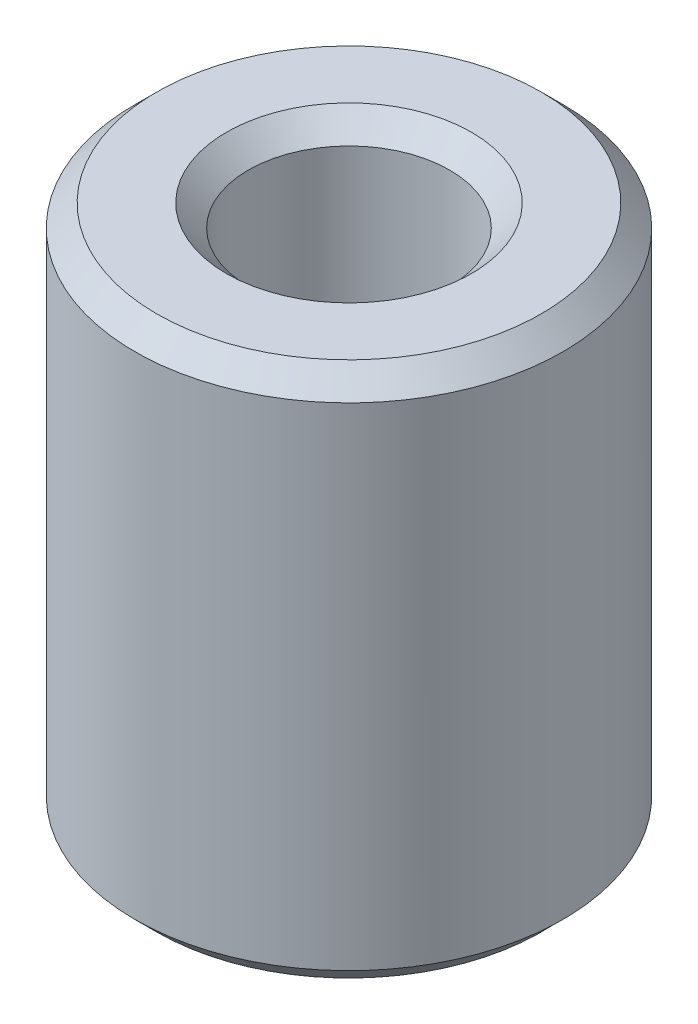
ISO-10303-21;
HEADER;
FILE_DESCRIPTION(('STEP AP214'),'2;1');
FILE_NAME('part.step','',(''),(''),'','','');
FILE_SCHEMA(('AUTOMOTIVE_DESIGN { 1 0 10303 214 1 1 1 1 }'));
ENDSEC;
DATA;
#1=APPLICATION_CONTEXT('core data for automotive mechanical design processes');
#2=APPLICATION_PROTOCOL_DEFINITION('international standard','automotive_design',2000,#1);
#3=PRODUCT_CONTEXT('',#1,'mechanical');
#4=PRODUCT('Part','Part','',(#3));
#5=PRODUCT_RELATED_PRODUCT_CATEGORY('part','',(#4));
#6=PRODUCT_DEFINITION_FORMATION('','',#4);
#7=PRODUCT_DEFINITION_CONTEXT('part definition',#1,'design');
#8=PRODUCT_DEFINITION('design','',#6,#7);
#9=PRODUCT_DEFINITION_SHAPE('','',#8);
#10=(LENGTH_UNIT() NAMED_UNIT(*) SI_UNIT(.MILLI.,.METRE.));
#11=(NAMED_UNIT(*) PLANE_ANGLE_UNIT() SI_UNIT($,.RADIAN.));
#12=(NAMED_UNIT(*) SI_UNIT($,.STERADIAN.) SOLID_ANGLE_UNIT());
#13=UNCERTAINTY_MEASURE_WITH_UNIT(LENGTH_MEASURE(1.E-05),#10,'distance_accuracy_value','');
#14=(GEOMETRIC_REPRESENTATION_CONTEXT(3) GLOBAL_UNCERTAINTY_ASSIGNED_CONTEXT((#13)) GLOBAL_UNIT_ASSIGNED_CONTEXT((#10,
#11,#12)) REPRESENTATION_CONTEXT('',''));
#15=CARTESIAN_POINT('',(0.,0.,0.));
#16=DIRECTION('',(0.,0.,1.));
#17=DIRECTION('',(1.,0.,0.));
#18=AXIS2_PLACEMENT_3D('',#15,#16,#17);
#19=CARTESIAN_POINT('',(0.,12.5053869454506,0.));
#20=DIRECTION('',(0.,-1.,0.));
#21=DIRECTION('',(0.,0.,-1.));
#22=AXIS2_PLACEMENT_3D('',#19,#20,#21);
#23=CYLINDRICAL_SURFACE('',#22,5.);
#24=CARTESIAN_POINT('',(0.,0.510197850316269,0.));
#25=DIRECTION('',(0.,1.,0.));
#26=DIRECTION('',(0.,0.,1.));
#27=AXIS2_PLACEMENT_3D('',#24,#25,#26);
#28=CIRCLE('',#27,5.);
#29=CARTESIAN_POINT('',(0.,0.510197850316269,-5.));
#30=VERTEX_POINT('',#29);
#31=EDGE_CURVE('E10',#30,#30,#28,.T.);
#32=CARTESIAN_POINT('',(0.,11.9951890951343,0.));
#33=DIRECTION('',(0.,1.,0.));
#34=DIRECTION('',(0.,0.,1.));
#35=AXIS2_PLACEMENT_3D('',#32,#33,#34);
#36=CIRCLE('',#35,5.);
#37=CARTESIAN_POINT('',(0.,11.9951890951343,-5.));
#38=VERTEX_POINT('',#37);
#39=EDGE_CURVE('E50',#38,#38,#36,.F.);
#40=CARTESIAN_POINT('',(0.,0.510197850316269,-5.));
#41=CARTESIAN_POINT('',(0.,0.629833175783124,-5.));
#42=CARTESIAN_POINT('',(0.,0.749468501249979,-5.));
#43=CARTESIAN_POINT('',(0.,0.988739152183689,-5.));
#44=CARTESIAN_POINT('',(0.,1.10837447765054,-5.));
#45=CARTESIAN_POINT('',(0.,1.34764512858425,-5.));
#46=CARTESIAN_POINT('',(0.,1.46728045405111,-5.));
#47=CARTESIAN_POINT('',(0.,1.70655110498482,-5.));
#48=CARTESIAN_POINT('',(0.,1.82618643045167,-5.));
#49=CARTESIAN_POINT('',(0.,2.06545708138538,-5.));
#50=CARTESIAN_POINT('',(0.,2.18509240685224,-5.));
#51=CARTESIAN_POINT('',(0.,2.42436305778595,-5.));
#52=CARTESIAN_POINT('',(0.,2.5439983832528,-5.));
#53=CARTESIAN_POINT('',(0.,2.78326903418651,-5.));
#54=CARTESIAN_POINT('',(0.,2.90290435965337,-5.));
#55=CARTESIAN_POINT('',(0.,3.14217501058708,-5.));
#56=CARTESIAN_POINT('',(0.,3.26181033605393,-5.));
#57=CARTESIAN_POINT('',(0.,3.50108098698764,-5.));
#58=CARTESIAN_POINT('',(0.,3.6207163124545,-5.));
#59=CARTESIAN_POINT('',(0.,3.85998696338821,-5.));
#60=CARTESIAN_POINT('',(0.,3.97962228885506,-5.));
#61=CARTESIAN_POINT('',(0.,4.21889293978877,-5.));
#62=CARTESIAN_POINT('',(0.,4.33852826525563,-5.));
#63=CARTESIAN_POINT('',(0.,4.57779891618934,-5.));
#64=CARTESIAN_POINT('',(0.,4.69743424165619,-5.));
#65=CARTESIAN_POINT('',(0.,4.9367048925899,-5.));
#66=CARTESIAN_POINT('',(0.,5.05634021805676,-5.));
#67=CARTESIAN_POINT('',(0.,5.29561086899047,-5.));
#68=CARTESIAN_POINT('',(0.,5.41524619445732,-5.));
#69=CARTESIAN_POINT('',(0.,5.65451684539103,-5.));
#70=CARTESIAN_POINT('',(0.,5.77415217085789,-5.));
#71=CARTESIAN_POINT('',(0.,6.0134228217916,-5.));
#72=CARTESIAN_POINT('',(0.,6.13305814725845,-5.));
#73=CARTESIAN_POINT('',(0.,6.37232879819216,-5.));
#74=CARTESIAN_POINT('',(0.,6.49196412365902,-5.));
#75=CARTESIAN_POINT('',(0.,6.73123477459273,-5.));
#76=CARTESIAN_POINT('',(0.,6.85087010005958,-5.));
#77=CARTESIAN_POINT('',(0.,7.09014075099329,-5.));
#78=CARTESIAN_POINT('',(0.,7.20977607646015,-5.));
#79=CARTESIAN_POINT('',(0.,7.44904672739386,-5.));
#80=CARTESIAN_POINT('',(0.,7.56868205286071,-5.));
#81=CARTESIAN_POINT('',(0.,7.80795270379442,-5.));
#82=CARTESIAN_POINT('',(0.,7.92758802926128,-5.));
#83=CARTESIAN_POINT('',(0.,8.16685868019499,-5.));
#84=CARTESIAN_POINT('',(0.,8.28649400566184,-5.));
#85=CARTESIAN_POINT('',(0.,8.52576465659555,-5.));
#86=CARTESIAN_POINT('',(0.,8.64539998206241,-5.));
#87=CARTESIAN_POINT('',(0.,8.88467063299611,-5.));
#88=CARTESIAN_POINT('',(0.,9.00430595846297,-5.));
#89=CARTESIAN_POINT('',(0.,9.24357660939668,-5.));
#90=CARTESIAN_POINT('',(0.,9.36321193486353,-5.));
#91=CARTESIAN_POINT('',(0.,9.60248258579724,-5.));
#92=CARTESIAN_POINT('',(0.,9.7221179112641,-5.));
#93=CARTESIAN_POINT('',(0.,9.96138856219781,-5.));
#94=CARTESIAN_POINT('',(0.,10.0810238876647,-5.));
#95=CARTESIAN_POINT('',(0.,10.3202945385984,-5.));
#96=CARTESIAN_POINT('',(0.,10.4399298640652,-5.));
#97=CARTESIAN_POINT('',(0.,10.6792005149989,-5.));
#98=CARTESIAN_POINT('',(0.,10.7988358404658,-5.));
#99=CARTESIAN_POINT('',(0.,11.0381064913995,-5.));
#100=CARTESIAN_POINT('',(0.,11.1577418168664,-5.));
#101=CARTESIAN_POINT('',(0.,11.3970124678001,-5.));
#102=CARTESIAN_POINT('',(0.,11.5166477932669,-5.));
#103=CARTESIAN_POINT('',(0.,11.7559184442006,-5.));
#104=CARTESIAN_POINT('',(0.,11.8755537696675,-5.));
#105=CARTESIAN_POINT('',(0.,11.9951890951343,-5.));
#106=B_SPLINE_CURVE_WITH_KNOTS('',3,(#40,#41,#42,#43,#44,#45,#46,#47,#48,#49,#50,#51,#52,#53,
#54,#55,#56,#57,#58,#59,#60,#61,#62,#63,#64,#65,#66,#67,#68,#69,#70,#71,#72,#73,#74,#75,#76,#77,
#78,#79,#80,#81,#82,#83,#84,#85,#86,#87,#88,#89,#90,#91,#92,#93,#94,#95,#96,#97,#98,#99,#100,
#101,#102,#103,#104,#105),.UNSPECIFIED.,.F.,.F.,(4,2,2,2,2,2,2,2,2,2,2,2,2,2,2,2,2,2,2,2,2,2,2,
2,2,2,2,2,2,2,2,2,4),(0.,0.358905976400564,0.71781195280113,1.07671792920169,1.43562390560226,
1.79452988200282,2.15343585840339,2.51234183480395,2.87124781120452,3.23015378760508,
3.58905976400565,3.94796574040621,4.30687171680678,4.66577769320734,5.02468366960791,
5.38358964600847,5.74249562240904,6.1014015988096,6.46030757521017,6.81921355161073,
7.1781195280113,7.53702550441186,7.89593148081243,8.25483745721299,8.61374343361356,
8.97264941001412,9.33155538641468,9.69046136281525,10.0493673392158,10.4082733156164,
10.7671792920169,11.1260852684175,11.4849912448181),.UNSPECIFIED.);
#107=EDGE_CURVE('BSEAM39',#30,#38,#106,.T.);
#108=ORIENTED_EDGE('',*,*,#31,.T.);
#109=ORIENTED_EDGE('',*,*,#39,.T.);
#110=ORIENTED_EDGE('',*,*,#107,.T.);
#111=ORIENTED_EDGE('',*,*,#107,.F.);
#112=EDGE_LOOP('',(#108,#110,#109,#111));
#113=FACE_BOUND('',#112,.T.);
#114=ADVANCED_FACE('F39',(#113),#23,.T.);
#115=CARTESIAN_POINT('',(0.,12.5053869454506,0.));
#116=DIRECTION('',(0.,1.,0.));
#117=DIRECTION('',(0.,0.,1.));
#118=AXIS2_PLACEMENT_3D('',#115,#116,#117);
#119=PLANE('',#118);
#120=CARTESIAN_POINT('',(0.,12.5053869454506,0.));
#121=DIRECTION('',(0.,1.,0.));
#122=DIRECTION('',(0.,0.,1.));
#123=AXIS2_PLACEMENT_3D('',#120,#121,#122);
#124=CIRCLE('',#123,2.86159839954905);
#125=CARTESIAN_POINT('',(0.,12.5053869454506,2.86159839954905));
#126=VERTEX_POINT('',#125);
#127=EDGE_CURVE('E58',#126,#126,#124,.F.);
#128=ORIENTED_EDGE('',*,*,#127,.T.);
#129=EDGE_LOOP('',(#128));
#130=FACE_BOUND('',#129,.T.);
#131=CARTESIAN_POINT('',(0.,12.5053869454506,0.));
#132=DIRECTION('',(0.,1.,0.));
#133=DIRECTION('',(0.,0.,1.));
#134=AXIS2_PLACEMENT_3D('',#131,#132,#133);
#135=CIRCLE('',#134,4.48980214968375);
#136=CARTESIAN_POINT('',(0.,12.5053869454506,4.48980214968375));
#137=VERTEX_POINT('',#136);
#138=EDGE_CURVE('E61',#137,#137,#135,.T.);
#139=ORIENTED_EDGE('',*,*,#138,.T.);
#140=EDGE_LOOP('',(#139));
#141=FACE_BOUND('',#140,.T.);
#142=ADVANCED_FACE('F88',(#130,#141),#119,.T.);
#143=CARTESIAN_POINT('',(0.,0.,0.));
#144=DIRECTION('',(0.,1.,0.));
#145=DIRECTION('',(0.,0.,1.));
#146=AXIS2_PLACEMENT_3D('',#143,#144,#145);
#147=PLANE('',#146);
#148=CARTESIAN_POINT('',(0.,0.,0.));
#149=DIRECTION('',(0.,1.,0.));
#150=DIRECTION('',(0.,0.,1.));
#151=AXIS2_PLACEMENT_3D('',#148,#149,#150);
#152=CIRCLE('',#151,2.86159839954903);
#153=CARTESIAN_POINT('',(0.,0.,2.86159839954903));
#154=VERTEX_POINT('',#153);
#155=EDGE_CURVE('E51',#154,#154,#152,.T.);
#156=ORIENTED_EDGE('',*,*,#155,.T.);
#157=EDGE_LOOP('',(#156));
#158=FACE_BOUND('',#157,.T.);
#159=CARTESIAN_POINT('',(0.,0.,0.));
#160=DIRECTION('',(0.,1.,0.));
#161=DIRECTION('',(0.,0.,1.));
#162=AXIS2_PLACEMENT_3D('',#159,#160,#161);
#163=CIRCLE('',#162,4.48980214968373);
#164=CARTESIAN_POINT('',(0.,0.,4.48980214968373));
#165=VERTEX_POINT('',#164);
#166=EDGE_CURVE('E54',#165,#165,#163,.F.);
#167=ORIENTED_EDGE('',*,*,#166,.T.);
#168=EDGE_LOOP('',(#167));
#169=FACE_BOUND('',#168,.T.);
#170=ADVANCED_FACE('F83',(#158,#169),#147,.F.);
#171=CARTESIAN_POINT('',(0.,12.5053869454506,0.));
#172=DIRECTION('',(0.,-1.,0.));
#173=DIRECTION('',(0.,0.,-1.));
#174=AXIS2_PLACEMENT_3D('',#171,#172,#173);
#175=CYLINDRICAL_SURFACE('',#174,2.35140054923278);
#176=CARTESIAN_POINT('',(0.,11.9951890951343,0.));
#177=DIRECTION('',(0.,1.,0.));
#178=DIRECTION('',(0.,0.,1.));
#179=AXIS2_PLACEMENT_3D('',#176,#177,#178);
#180=CIRCLE('',#179,2.35140054923278);
#181=CARTESIAN_POINT('',(0.,11.9951890951343,-2.35140054923278));
#182=VERTEX_POINT('',#181);
#183=EDGE_CURVE('E67',#182,#182,#180,.T.);
#184=CARTESIAN_POINT('',(0.,0.510197850316261,0.));
#185=DIRECTION('',(0.,1.,0.));
#186=DIRECTION('',(0.,0.,1.));
#187=AXIS2_PLACEMENT_3D('',#184,#185,#186);
#188=CIRCLE('',#187,2.35140054923278);
#189=CARTESIAN_POINT('',(0.,0.510197850316259,-2.35140054923278));
#190=VERTEX_POINT('',#189);
#191=EDGE_CURVE('E69',#190,#190,#188,.F.);
#192=CARTESIAN_POINT('',(0.,11.9951890951343,-2.35140054923278));
#193=CARTESIAN_POINT('',(0.,11.8755537696675,-2.35140054923278));
#194=CARTESIAN_POINT('',(0.,11.7559184442006,-2.35140054923278));
#195=CARTESIAN_POINT('',(0.,11.5166477932669,-2.35140054923278));
#196=CARTESIAN_POINT('',(0.,11.3970124678001,-2.35140054923278));
#197=CARTESIAN_POINT('',(0.,11.1577418168664,-2.35140054923278));
#198=CARTESIAN_POINT('',(0.,11.0381064913995,-2.35140054923278));
#199=CARTESIAN_POINT('',(0.,10.7988358404658,-2.35140054923278));
#200=CARTESIAN_POINT('',(0.,10.6792005149989,-2.35140054923278));
#201=CARTESIAN_POINT('',(0.,10.4399298640652,-2.35140054923278));
#202=CARTESIAN_POINT('',(0.,10.3202945385984,-2.35140054923278));
#203=CARTESIAN_POINT('',(0.,10.0810238876647,-2.35140054923278));
#204=CARTESIAN_POINT('',(0.,9.9613885621978,-2.35140054923278));
#205=CARTESIAN_POINT('',(0.,9.72211791126409,-2.35140054923278));
#206=CARTESIAN_POINT('',(0.,9.60248258579723,-2.35140054923278));
#207=CARTESIAN_POINT('',(0.,9.36321193486352,-2.35140054923278));
#208=CARTESIAN_POINT('',(0.,9.24357660939667,-2.35140054923278));
#209=CARTESIAN_POINT('',(0.,9.00430595846296,-2.35140054923278));
#210=CARTESIAN_POINT('',(0.,8.8846706329961,-2.35140054923278));
#211=CARTESIAN_POINT('',(0.,8.6453999820624,-2.35140054923278));
#212=CARTESIAN_POINT('',(0.,8.52576465659554,-2.35140054923278));
#213=CARTESIAN_POINT('',(0.,8.28649400566183,-2.35140054923278));
#214=CARTESIAN_POINT('',(0.,8.16685868019498,-2.35140054923278));
#215=CARTESIAN_POINT('',(0.,7.92758802926127,-2.35140054923278));
#216=CARTESIAN_POINT('',(0.,7.80795270379441,-2.35140054923278));
#217=CARTESIAN_POINT('',(0.,7.5686820528607,-2.35140054923278));
#218=CARTESIAN_POINT('',(0.,7.44904672739385,-2.35140054923278));
#219=CARTESIAN_POINT('',(0.,7.20977607646014,-2.35140054923278));
#220=CARTESIAN_POINT('',(0.,7.09014075099328,-2.35140054923278));
#221=CARTESIAN_POINT('',(0.,6.85087010005957,-2.35140054923278));
#222=CARTESIAN_POINT('',(0.,6.73123477459272,-2.35140054923278));
#223=CARTESIAN_POINT('',(0.,6.49196412365901,-2.35140054923278));
#224=CARTESIAN_POINT('',(0.,6.37232879819215,-2.35140054923278));
#225=CARTESIAN_POINT('',(0.,6.13305814725844,-2.35140054923278));
#226=CARTESIAN_POINT('',(0.,6.01342282179159,-2.35140054923278));
#227=CARTESIAN_POINT('',(0.,5.77415217085788,-2.35140054923278));
#228=CARTESIAN_POINT('',(0.,5.65451684539102,-2.35140054923278));
#229=CARTESIAN_POINT('',(0.,5.41524619445731,-2.35140054923278));
#230=CARTESIAN_POINT('',(0.,5.29561086899046,-2.35140054923278));
#231=CARTESIAN_POINT('',(0.,5.05634021805675,-2.35140054923278));
#232=CARTESIAN_POINT('',(0.,4.93670489258989,-2.35140054923278));
#233=CARTESIAN_POINT('',(0.,4.69743424165618,-2.35140054923278));
#234=CARTESIAN_POINT('',(0.,4.57779891618933,-2.35140054923278));
#235=CARTESIAN_POINT('',(0.,4.33852826525562,-2.35140054923278));
#236=CARTESIAN_POINT('',(0.,4.21889293978876,-2.35140054923278));
#237=CARTESIAN_POINT('',(0.,3.97962228885505,-2.35140054923278));
#238=CARTESIAN_POINT('',(0.,3.8599869633882,-2.35140054923278));
#239=CARTESIAN_POINT('',(0.,3.62071631245449,-2.35140054923278));
#240=CARTESIAN_POINT('',(0.,3.50108098698763,-2.35140054923278));
#241=CARTESIAN_POINT('',(0.,3.26181033605392,-2.35140054923278));
#242=CARTESIAN_POINT('',(0.,3.14217501058707,-2.35140054923278));
#243=CARTESIAN_POINT('',(0.,2.90290435965336,-2.35140054923278));
#244=CARTESIAN_POINT('',(0.,2.7832690341865,-2.35140054923278));
#245=CARTESIAN_POINT('',(0.,2.54399838325279,-2.35140054923278));
#246=CARTESIAN_POINT('',(0.,2.42436305778594,-2.35140054923278));
#247=CARTESIAN_POINT('',(0.,2.18509240685223,-2.35140054923278));
#248=CARTESIAN_POINT('',(0.,2.06545708138537,-2.35140054923278));
#249=CARTESIAN_POINT('',(0.,1.82618643045166,-2.35140054923278));
#250=CARTESIAN_POINT('',(0.,1.70655110498481,-2.35140054923278));
#251=CARTESIAN_POINT('',(0.,1.4672804540511,-2.35140054923278));
#252=CARTESIAN_POINT('',(0.,1.34764512858424,-2.35140054923278));
#253=CARTESIAN_POINT('',(0.,1.10837447765053,-2.35140054923278));
#254=CARTESIAN_POINT('',(0.,0.988739152183678,-2.35140054923278));
#255=CARTESIAN_POINT('',(0.,0.749468501249968,-2.35140054923278));
#256=CARTESIAN_POINT('',(0.,0.629833175783113,-2.35140054923278));
#257=CARTESIAN_POINT('',(0.,0.510197850316259,-2.35140054923278));
#258=B_SPLINE_CURVE_WITH_KNOTS('',3,(#192,#193,#194,#195,#196,#197,#198,#199,#200,#201,#202,
#203,#204,#205,#206,#207,#208,#209,#210,#211,#212,#213,#214,#215,#216,#217,#218,#219,#220,#221,
#222,#223,#224,#225,#226,#227,#228,#229,#230,#231,#232,#233,#234,#235,#236,#237,#238,#239,#240,
#241,#242,#243,#244,#245,#246,#247,#248,#249,#250,#251,#252,#253,#254,#255,#256,#257),
.UNSPECIFIED.,.F.,.F.,(4,2,2,2,2,2,2,2,2,2,2,2,2,2,2,2,2,2,2,2,2,2,2,2,2,2,2,2,2,2,2,2,4),(0.,
0.358905976400564,0.717811952801128,1.07671792920169,1.43562390560226,1.79452988200282,
2.15343585840339,2.51234183480395,2.87124781120452,3.23015378760508,3.58905976400565,
3.94796574040621,4.30687171680678,4.66577769320734,5.02468366960791,5.38358964600847,
5.74249562240904,6.1014015988096,6.46030757521017,6.81921355161073,7.1781195280113,
7.53702550441186,7.89593148081242,8.25483745721299,8.61374343361356,8.97264941001412,
9.33155538641468,9.69046136281525,10.0493673392158,10.4082733156164,10.7671792920169,
11.1260852684175,11.4849912448181),.UNSPECIFIED.);
#259=EDGE_CURVE('BSEAM71',#182,#190,#258,.T.);
#260=ORIENTED_EDGE('',*,*,#183,.T.);
#261=ORIENTED_EDGE('',*,*,#191,.T.);
#262=ORIENTED_EDGE('',*,*,#259,.T.);
#263=ORIENTED_EDGE('',*,*,#259,.F.);
#264=EDGE_LOOP('',(#260,#262,#261,#263));
#265=FACE_BOUND('',#264,.T.);
#266=ADVANCED_FACE('F71',(#265),#175,.F.);
#267=CARTESIAN_POINT('',(0.,11.9951890951343,0.));
#268=DIRECTION('',(0.,1.,0.));
#269=DIRECTION('',(0.,0.,1.));
#270=AXIS2_PLACEMENT_3D('',#267,#268,#269);
#271=CONICAL_SURFACE('',#270,2.35140054923278,0.785398163397454);
#272=ORIENTED_EDGE('',*,*,#127,.F.);
#273=EDGE_LOOP('',(#272));
#274=FACE_BOUND('',#273,.T.);
#275=ORIENTED_EDGE('',*,*,#183,.F.);
#276=EDGE_LOOP('',(#275));
#277=FACE_BOUND('',#276,.T.);
#278=ADVANCED_FACE('F77',(#274,#277),#271,.F.);
#279=CARTESIAN_POINT('',(0.,0.,0.));
#280=DIRECTION('',(0.,-1.,0.));
#281=DIRECTION('',(0.,0.,-1.));
#282=AXIS2_PLACEMENT_3D('',#279,#280,#281);
#283=CONICAL_SURFACE('',#282,2.86159839954903,0.785398163397442);
#284=ORIENTED_EDGE('',*,*,#191,.F.);
#285=EDGE_LOOP('',(#284));
#286=FACE_BOUND('',#285,.T.);
#287=ORIENTED_EDGE('',*,*,#155,.F.);
#288=EDGE_LOOP('',(#287));
#289=FACE_BOUND('',#288,.T.);
#290=ADVANCED_FACE('F73',(#286,#289),#283,.F.);
#291=CARTESIAN_POINT('',(0.,0.510197850316269,0.));
#292=DIRECTION('',(0.,1.,0.));
#293=DIRECTION('',(0.,0.,1.));
#294=AXIS2_PLACEMENT_3D('',#291,#292,#293);
#295=CONICAL_SURFACE('',#294,5.,0.785398163397452);
#296=ORIENTED_EDGE('',*,*,#166,.F.);
#297=EDGE_LOOP('',(#296));
#298=FACE_BOUND('',#297,.T.);
#299=ORIENTED_EDGE('',*,*,#31,.F.);
#300=EDGE_LOOP('',(#299));
#301=FACE_BOUND('',#300,.T.);
#302=ADVANCED_FACE('F76',(#298,#301),#295,.T.);
#303=CARTESIAN_POINT('',(0.,12.5053869454506,0.));
#304=DIRECTION('',(0.,-1.,0.));
#305=DIRECTION('',(0.,0.,-1.));
#306=AXIS2_PLACEMENT_3D('',#303,#304,#305);
#307=CONICAL_SURFACE('',#306,4.48980214968375,0.785398163397443);
#308=ORIENTED_EDGE('',*,*,#39,.F.);
#309=EDGE_LOOP('',(#308));
#310=FACE_BOUND('',#309,.T.);
#311=ORIENTED_EDGE('',*,*,#138,.F.);
#312=EDGE_LOOP('',(#311));
#313=FACE_BOUND('',#312,.T.);
#314=ADVANCED_FACE('F45',(#310,#313),#307,.T.);
#315=CLOSED_SHELL('',(#114,#142,#170,#266,#278,#290,#302,#314));
#316=MANIFOLD_SOLID_BREP('B2',#315);
#317=ADVANCED_BREP_SHAPE_REPRESENTATION('',(#18,#316),#14);
#318=SHAPE_DEFINITION_REPRESENTATION(#9,#317);
ENDSEC;
END-ISO-10303-21;
